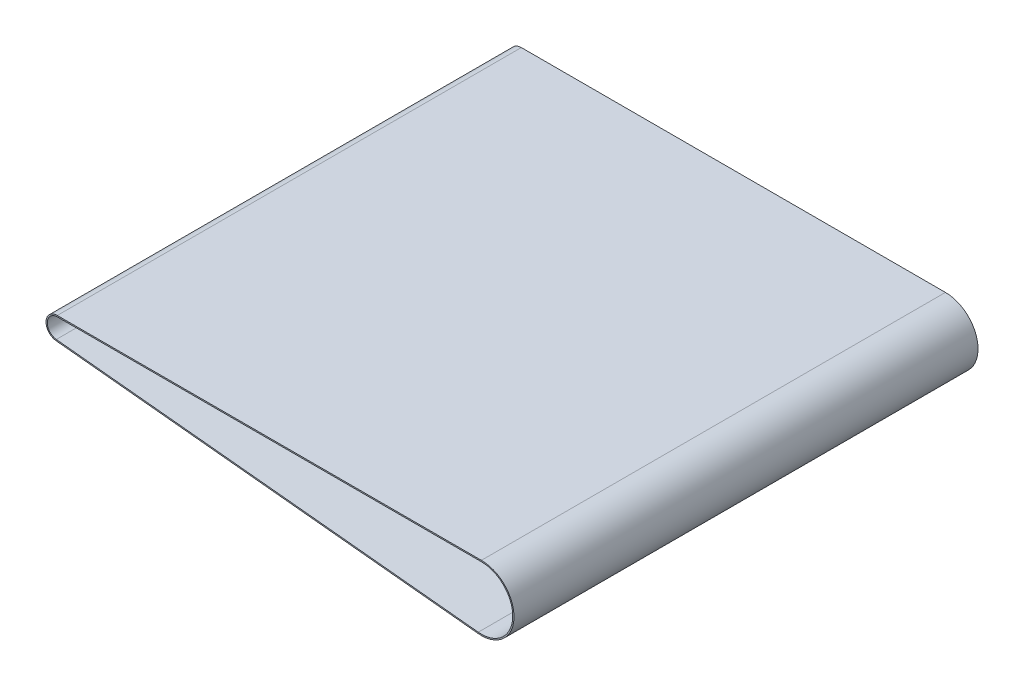
ISO-10303-21;
HEADER;
FILE_DESCRIPTION(('STEP AP214'),'2;1');
FILE_NAME('part.step','',(''),(''),'','','');
FILE_SCHEMA(('AUTOMOTIVE_DESIGN { 1 0 10303 214 1 1 1 1 }'));
ENDSEC;
DATA;
#1=APPLICATION_CONTEXT('core data for automotive mechanical design processes');
#2=APPLICATION_PROTOCOL_DEFINITION('international standard','automotive_design',2000,#1);
#3=PRODUCT_CONTEXT('',#1,'mechanical');
#4=PRODUCT('Part','Part','',(#3));
#5=PRODUCT_RELATED_PRODUCT_CATEGORY('part','',(#4));
#6=PRODUCT_DEFINITION_FORMATION('','',#4);
#7=PRODUCT_DEFINITION_CONTEXT('part definition',#1,'design');
#8=PRODUCT_DEFINITION('design','',#6,#7);
#9=PRODUCT_DEFINITION_SHAPE('','',#8);
#10=(LENGTH_UNIT() NAMED_UNIT(*) SI_UNIT(.MILLI.,.METRE.));
#11=(NAMED_UNIT(*) PLANE_ANGLE_UNIT() SI_UNIT($,.RADIAN.));
#12=(NAMED_UNIT(*) SI_UNIT($,.STERADIAN.) SOLID_ANGLE_UNIT());
#13=UNCERTAINTY_MEASURE_WITH_UNIT(LENGTH_MEASURE(1.E-05),#10,'distance_accuracy_value','');
#14=(GEOMETRIC_REPRESENTATION_CONTEXT(3) GLOBAL_UNCERTAINTY_ASSIGNED_CONTEXT((#13)) GLOBAL_UNIT_ASSIGNED_CONTEXT((#10,
#11,#12)) REPRESENTATION_CONTEXT('',''));
#15=CARTESIAN_POINT('',(0.,0.,0.));
#16=DIRECTION('',(0.,0.,1.));
#17=DIRECTION('',(1.,0.,0.));
#18=AXIS2_PLACEMENT_3D('',#15,#16,#17);
#19=CARTESIAN_POINT('',(313.926819645224,-25.,370.));
#20=DIRECTION('',(0.,0.,1.));
#21=DIRECTION('',(1.,0.,0.));
#22=AXIS2_PLACEMENT_3D('',#19,#20,#21);
#23=PLANE('',#22);
#24=CARTESIAN_POINT('',(313.926819645224,-25.,370.));
#25=DIRECTION('',(0.,0.,1.));
#26=DIRECTION('',(1.,0.,0.));
#27=AXIS2_PLACEMENT_3D('',#24,#25,#26);
#28=CIRCLE('',#27,26.);
#29=CARTESIAN_POINT('',(311.319362053731,-50.8689227628165,370.));
#30=VERTEX_POINT('',#29);
#31=CARTESIAN_POINT('',(313.926819645224,1.,370.));
#32=VERTEX_POINT('',#31);
#33=EDGE_CURVE('E136',#30,#32,#28,.T.);
#34=ORIENTED_EDGE('',*,*,#33,.T.);
#35=DIRECTION('',(-1.,0.,0.));
#36=VECTOR('',#35,1.);
#37=CARTESIAN_POINT('',(-24.2461538461538,0.999999999999999,370.));
#38=LINE('',#37,#36);
#39=CARTESIAN_POINT('',(-24.2461538461538,0.999999999999994,370.));
#40=VERTEX_POINT('',#39);
#41=EDGE_CURVE('E139',#32,#40,#38,.T.);
#42=ORIENTED_EDGE('',*,*,#41,.T.);
#43=CARTESIAN_POINT('',(-24.2461538461538,-8.,370.));
#44=DIRECTION('',(0.,0.,1.));
#45=DIRECTION('',(1.,0.,0.));
#46=AXIS2_PLACEMENT_3D('',#43,#44,#45);
#47=CIRCLE('',#46,8.99999999999999);
#48=CARTESIAN_POINT('',(-25.1487353201322,-16.9546271102057,370.));
#49=VERTEX_POINT('',#48);
#50=EDGE_CURVE('E142',#40,#49,#47,.T.);
#51=ORIENTED_EDGE('',*,*,#50,.T.);
#52=DIRECTION('',(0.994958567800634,-0.100286830442042,0.));
#53=VECTOR('',#52,1.);
#54=CARTESIAN_POINT('',(-25.1487353201322,-16.9546271102057,370.));
#55=LINE('',#54,#53);
#56=EDGE_CURVE('E144',#49,#30,#55,.T.);
#57=ORIENTED_EDGE('',*,*,#56,.T.);
#58=EDGE_LOOP('',(#34,#42,#51,#57));
#59=FACE_BOUND('',#58,.T.);
#60=DIRECTION('',(-1.,0.,0.));
#61=VECTOR('',#60,1.);
#62=CARTESIAN_POINT('',(-24.2461538461538,0.,370.));
#63=LINE('',#62,#61);
#64=CARTESIAN_POINT('',(313.926819645224,0.,370.));
#65=VERTEX_POINT('',#64);
#66=CARTESIAN_POINT('',(-24.2461538461538,0.,370.));
#67=VERTEX_POINT('',#66);
#68=EDGE_CURVE('E108',#65,#67,#63,.T.);
#69=ORIENTED_EDGE('',*,*,#68,.F.);
#70=CARTESIAN_POINT('',(313.926819645224,-25.,370.));
#71=DIRECTION('',(0.,0.,1.));
#72=DIRECTION('',(1.,0.,0.));
#73=AXIS2_PLACEMENT_3D('',#70,#71,#72);
#74=CIRCLE('',#73,25.);
#75=CARTESIAN_POINT('',(311.419648884173,-49.8739641950158,370.));
#76=VERTEX_POINT('',#75);
#77=EDGE_CURVE('E100',#76,#65,#74,.T.);
#78=ORIENTED_EDGE('',*,*,#77,.F.);
#79=DIRECTION('',(0.994958567800634,-0.100286830442041,0.));
#80=VECTOR('',#79,1.);
#81=CARTESIAN_POINT('',(-25.0484484896902,-15.9596685424051,370.));
#82=LINE('',#81,#80);
#83=CARTESIAN_POINT('',(-25.0484484896901,-15.9596685424051,370.));
#84=VERTEX_POINT('',#83);
#85=EDGE_CURVE('E122',#84,#76,#82,.T.);
#86=ORIENTED_EDGE('',*,*,#85,.F.);
#87=CARTESIAN_POINT('',(-24.2461538461538,-8.,370.));
#88=DIRECTION('',(0.,0.,1.));
#89=DIRECTION('',(1.,0.,0.));
#90=AXIS2_PLACEMENT_3D('',#87,#88,#89);
#91=CIRCLE('',#90,8.);
#92=EDGE_CURVE('E120',#67,#84,#91,.T.);
#93=ORIENTED_EDGE('',*,*,#92,.F.);
#94=EDGE_LOOP('',(#69,#78,#86,#93));
#95=FACE_BOUND('',#94,.T.);
#96=ADVANCED_FACE('F35',(#59,#95),#23,.T.);
#97=CARTESIAN_POINT('',(313.926819645224,-25.,0.));
#98=DIRECTION('',(0.,0.,1.));
#99=DIRECTION('',(1.,0.,0.));
#100=AXIS2_PLACEMENT_3D('',#97,#98,#99);
#101=PLANE('',#100);
#102=CARTESIAN_POINT('',(313.926819645224,-25.,0.));
#103=DIRECTION('',(0.,0.,1.));
#104=DIRECTION('',(1.,0.,0.));
#105=AXIS2_PLACEMENT_3D('',#102,#103,#104);
#106=CIRCLE('',#105,26.);
#107=CARTESIAN_POINT('',(311.319362053731,-50.8689227628165,0.));
#108=VERTEX_POINT('',#107);
#109=CARTESIAN_POINT('',(313.926819645224,1.,0.));
#110=VERTEX_POINT('',#109);
#111=EDGE_CURVE('E116',#108,#110,#106,.T.);
#112=ORIENTED_EDGE('',*,*,#111,.F.);
#113=DIRECTION('',(0.994958567800634,-0.100286830442042,0.));
#114=VECTOR('',#113,1.);
#115=CARTESIAN_POINT('',(-25.1487353201322,-16.9546271102057,0.));
#116=LINE('',#115,#114);
#117=CARTESIAN_POINT('',(-25.1487353201322,-16.9546271102057,0.));
#118=VERTEX_POINT('',#117);
#119=EDGE_CURVE('E140',#118,#108,#116,.T.);
#120=ORIENTED_EDGE('',*,*,#119,.F.);
#121=CARTESIAN_POINT('',(-24.2461538461538,-8.,0.));
#122=DIRECTION('',(0.,0.,1.));
#123=DIRECTION('',(1.,0.,0.));
#124=AXIS2_PLACEMENT_3D('',#121,#122,#123);
#125=CIRCLE('',#124,8.99999999999999);
#126=CARTESIAN_POINT('',(-24.2461538461538,0.999999999999994,0.));
#127=VERTEX_POINT('',#126);
#128=EDGE_CURVE('E151',#127,#118,#125,.T.);
#129=ORIENTED_EDGE('',*,*,#128,.F.);
#130=DIRECTION('',(-1.,0.,0.));
#131=VECTOR('',#130,1.);
#132=CARTESIAN_POINT('',(-24.2461538461538,0.999999999999999,0.));
#133=LINE('',#132,#131);
#134=EDGE_CURVE('E149',#110,#127,#133,.T.);
#135=ORIENTED_EDGE('',*,*,#134,.F.);
#136=EDGE_LOOP('',(#112,#120,#129,#135));
#137=FACE_BOUND('',#136,.T.);
#138=CARTESIAN_POINT('',(313.926819645224,-25.,0.));
#139=DIRECTION('',(0.,0.,1.));
#140=DIRECTION('',(1.,0.,0.));
#141=AXIS2_PLACEMENT_3D('',#138,#139,#140);
#142=CIRCLE('',#141,25.);
#143=CARTESIAN_POINT('',(311.419648884173,-49.8739641950158,0.));
#144=VERTEX_POINT('',#143);
#145=CARTESIAN_POINT('',(313.926819645224,0.,0.));
#146=VERTEX_POINT('',#145);
#147=EDGE_CURVE('E58',#144,#146,#142,.T.);
#148=ORIENTED_EDGE('',*,*,#147,.T.);
#149=DIRECTION('',(-1.,0.,0.));
#150=VECTOR('',#149,1.);
#151=CARTESIAN_POINT('',(-24.2461538461538,0.,0.));
#152=LINE('',#151,#150);
#153=CARTESIAN_POINT('',(-24.2461538461538,0.,0.));
#154=VERTEX_POINT('',#153);
#155=EDGE_CURVE('E115',#146,#154,#152,.T.);
#156=ORIENTED_EDGE('',*,*,#155,.T.);
#157=CARTESIAN_POINT('',(-24.2461538461538,-8.,0.));
#158=DIRECTION('',(0.,0.,1.));
#159=DIRECTION('',(1.,0.,0.));
#160=AXIS2_PLACEMENT_3D('',#157,#158,#159);
#161=CIRCLE('',#160,8.);
#162=CARTESIAN_POINT('',(-25.0484484896902,-15.9596685424051,0.));
#163=VERTEX_POINT('',#162);
#164=EDGE_CURVE('E128',#154,#163,#161,.T.);
#165=ORIENTED_EDGE('',*,*,#164,.T.);
#166=DIRECTION('',(0.994958567800634,-0.100286830442041,0.));
#167=VECTOR('',#166,1.);
#168=CARTESIAN_POINT('',(-25.0484484896902,-15.9596685424051,0.));
#169=LINE('',#168,#167);
#170=EDGE_CURVE('E109',#163,#144,#169,.T.);
#171=ORIENTED_EDGE('',*,*,#170,.T.);
#172=EDGE_LOOP('',(#148,#156,#165,#171));
#173=FACE_BOUND('',#172,.T.);
#174=ADVANCED_FACE('F169',(#137,#173),#101,.F.);
#175=CARTESIAN_POINT('',(313.926819645224,-25.,370.));
#176=DIRECTION('',(0.,0.,-1.));
#177=DIRECTION('',(-1.,0.,0.));
#178=AXIS2_PLACEMENT_3D('',#175,#176,#177);
#179=CYLINDRICAL_SURFACE('',#178,26.);
#180=ORIENTED_EDGE('',*,*,#111,.T.);
#181=DIRECTION('',(0.,0.,-1.));
#182=VECTOR('',#181,1.);
#183=CARTESIAN_POINT('',(313.926819645224,1.,370.));
#184=LINE('',#183,#182);
#185=EDGE_CURVE('E11',#32,#110,#184,.T.);
#186=ORIENTED_EDGE('',*,*,#185,.F.);
#187=ORIENTED_EDGE('',*,*,#33,.F.);
#188=DIRECTION('',(0.,0.,-1.));
#189=VECTOR('',#188,1.);
#190=CARTESIAN_POINT('',(311.319362053731,-50.8689227628165,370.));
#191=LINE('',#190,#189);
#192=EDGE_CURVE('E146',#30,#108,#191,.T.);
#193=ORIENTED_EDGE('',*,*,#192,.T.);
#194=EDGE_LOOP('',(#180,#186,#187,#193));
#195=FACE_BOUND('',#194,.T.);
#196=ADVANCED_FACE('F37',(#195),#179,.T.);
#197=CARTESIAN_POINT('',(-24.2461538461538,0.999999999999999,370.));
#198=DIRECTION('',(0.,-1.,0.));
#199=DIRECTION('',(1.,0.,0.));
#200=AXIS2_PLACEMENT_3D('',#197,#198,#199);
#201=PLANE('',#200);
#202=ORIENTED_EDGE('',*,*,#134,.T.);
#203=DIRECTION('',(0.,0.,-1.));
#204=VECTOR('',#203,1.);
#205=CARTESIAN_POINT('',(-24.2461538461538,0.999999999999994,370.));
#206=LINE('',#205,#204);
#207=EDGE_CURVE('E43',#40,#127,#206,.T.);
#208=ORIENTED_EDGE('',*,*,#207,.F.);
#209=ORIENTED_EDGE('',*,*,#41,.F.);
#210=ORIENTED_EDGE('',*,*,#185,.T.);
#211=EDGE_LOOP('',(#202,#208,#209,#210));
#212=FACE_BOUND('',#211,.T.);
#213=ADVANCED_FACE('F179',(#212),#201,.F.);
#214=CARTESIAN_POINT('',(-24.2461538461538,-8.,370.));
#215=DIRECTION('',(0.,0.,-1.));
#216=DIRECTION('',(-1.,0.,0.));
#217=AXIS2_PLACEMENT_3D('',#214,#215,#216);
#218=CYLINDRICAL_SURFACE('',#217,8.99999999999999);
#219=ORIENTED_EDGE('',*,*,#128,.T.);
#220=DIRECTION('',(0.,0.,-1.));
#221=VECTOR('',#220,1.);
#222=CARTESIAN_POINT('',(-25.1487353201322,-16.9546271102057,370.));
#223=LINE('',#222,#221);
#224=EDGE_CURVE('E156',#49,#118,#223,.T.);
#225=ORIENTED_EDGE('',*,*,#224,.F.);
#226=ORIENTED_EDGE('',*,*,#50,.F.);
#227=ORIENTED_EDGE('',*,*,#207,.T.);
#228=EDGE_LOOP('',(#219,#225,#226,#227));
#229=FACE_BOUND('',#228,.T.);
#230=ADVANCED_FACE('F163',(#229),#218,.T.);
#231=CARTESIAN_POINT('',(-25.1487353201322,-16.9546271102057,370.));
#232=DIRECTION('',(0.100286830442041,0.994958567800634,0.));
#233=DIRECTION('',(-0.994958567800634,0.100286830442042,0.));
#234=AXIS2_PLACEMENT_3D('',#231,#232,#233);
#235=PLANE('',#234);
#236=ORIENTED_EDGE('',*,*,#119,.T.);
#237=ORIENTED_EDGE('',*,*,#192,.F.);
#238=ORIENTED_EDGE('',*,*,#56,.F.);
#239=ORIENTED_EDGE('',*,*,#224,.T.);
#240=EDGE_LOOP('',(#236,#237,#238,#239));
#241=FACE_BOUND('',#240,.T.);
#242=ADVANCED_FACE('F173',(#241),#235,.F.);
#243=CARTESIAN_POINT('',(313.926819645224,-25.,370.));
#244=DIRECTION('',(0.,0.,-1.));
#245=DIRECTION('',(-1.,0.,0.));
#246=AXIS2_PLACEMENT_3D('',#243,#244,#245);
#247=CYLINDRICAL_SURFACE('',#246,25.);
#248=ORIENTED_EDGE('',*,*,#147,.F.);
#249=DIRECTION('',(0.,0.,-1.));
#250=VECTOR('',#249,1.);
#251=CARTESIAN_POINT('',(311.419648884173,-49.8739641950158,370.));
#252=LINE('',#251,#250);
#253=EDGE_CURVE('E104',#76,#144,#252,.T.);
#254=ORIENTED_EDGE('',*,*,#253,.F.);
#255=ORIENTED_EDGE('',*,*,#77,.T.);
#256=DIRECTION('',(0.,0.,-1.));
#257=VECTOR('',#256,1.);
#258=CARTESIAN_POINT('',(313.926819645224,0.,370.));
#259=LINE('',#258,#257);
#260=EDGE_CURVE('E103',#65,#146,#259,.T.);
#261=ORIENTED_EDGE('',*,*,#260,.T.);
#262=EDGE_LOOP('',(#248,#254,#255,#261));
#263=FACE_BOUND('',#262,.T.);
#264=ADVANCED_FACE('F102',(#263),#247,.F.);
#265=CARTESIAN_POINT('',(-24.2461538461538,0.,370.));
#266=DIRECTION('',(0.,-1.,0.));
#267=DIRECTION('',(1.,0.,0.));
#268=AXIS2_PLACEMENT_3D('',#265,#266,#267);
#269=PLANE('',#268);
#270=ORIENTED_EDGE('',*,*,#155,.F.);
#271=ORIENTED_EDGE('',*,*,#260,.F.);
#272=ORIENTED_EDGE('',*,*,#68,.T.);
#273=DIRECTION('',(0.,0.,-1.));
#274=VECTOR('',#273,1.);
#275=CARTESIAN_POINT('',(-24.2461538461538,0.,370.));
#276=LINE('',#275,#274);
#277=EDGE_CURVE('E117',#67,#154,#276,.T.);
#278=ORIENTED_EDGE('',*,*,#277,.T.);
#279=EDGE_LOOP('',(#270,#271,#272,#278));
#280=FACE_BOUND('',#279,.T.);
#281=ADVANCED_FACE('F112',(#280),#269,.T.);
#282=CARTESIAN_POINT('',(-24.2461538461538,-8.,370.));
#283=DIRECTION('',(0.,0.,-1.));
#284=DIRECTION('',(-1.,0.,0.));
#285=AXIS2_PLACEMENT_3D('',#282,#283,#284);
#286=CYLINDRICAL_SURFACE('',#285,8.);
#287=ORIENTED_EDGE('',*,*,#164,.F.);
#288=ORIENTED_EDGE('',*,*,#277,.F.);
#289=ORIENTED_EDGE('',*,*,#92,.T.);
#290=DIRECTION('',(0.,0.,-1.));
#291=VECTOR('',#290,1.);
#292=CARTESIAN_POINT('',(-25.0484484896902,-15.9596685424051,370.));
#293=LINE('',#292,#291);
#294=EDGE_CURVE('E50',#84,#163,#293,.T.);
#295=ORIENTED_EDGE('',*,*,#294,.T.);
#296=EDGE_LOOP('',(#287,#288,#289,#295));
#297=FACE_BOUND('',#296,.T.);
#298=ADVANCED_FACE('F202',(#297),#286,.F.);
#299=CARTESIAN_POINT('',(-25.0484484896902,-15.9596685424051,370.));
#300=DIRECTION('',(0.100286830442041,0.994958567800634,0.));
#301=DIRECTION('',(-0.994958567800634,0.100286830442041,0.));
#302=AXIS2_PLACEMENT_3D('',#299,#300,#301);
#303=PLANE('',#302);
#304=ORIENTED_EDGE('',*,*,#170,.F.);
#305=ORIENTED_EDGE('',*,*,#294,.F.);
#306=ORIENTED_EDGE('',*,*,#85,.T.);
#307=ORIENTED_EDGE('',*,*,#253,.T.);
#308=EDGE_LOOP('',(#304,#305,#306,#307));
#309=FACE_BOUND('',#308,.T.);
#310=ADVANCED_FACE('F206',(#309),#303,.T.);
#311=CLOSED_SHELL('',(#96,#174,#196,#213,#230,#242,#264,#281,#298,#310));
#312=MANIFOLD_SOLID_BREP('B2',#311);
#313=ADVANCED_BREP_SHAPE_REPRESENTATION('',(#18,#312),#14);
#314=SHAPE_DEFINITION_REPRESENTATION(#9,#313);
ENDSEC;
END-ISO-10303-21;
